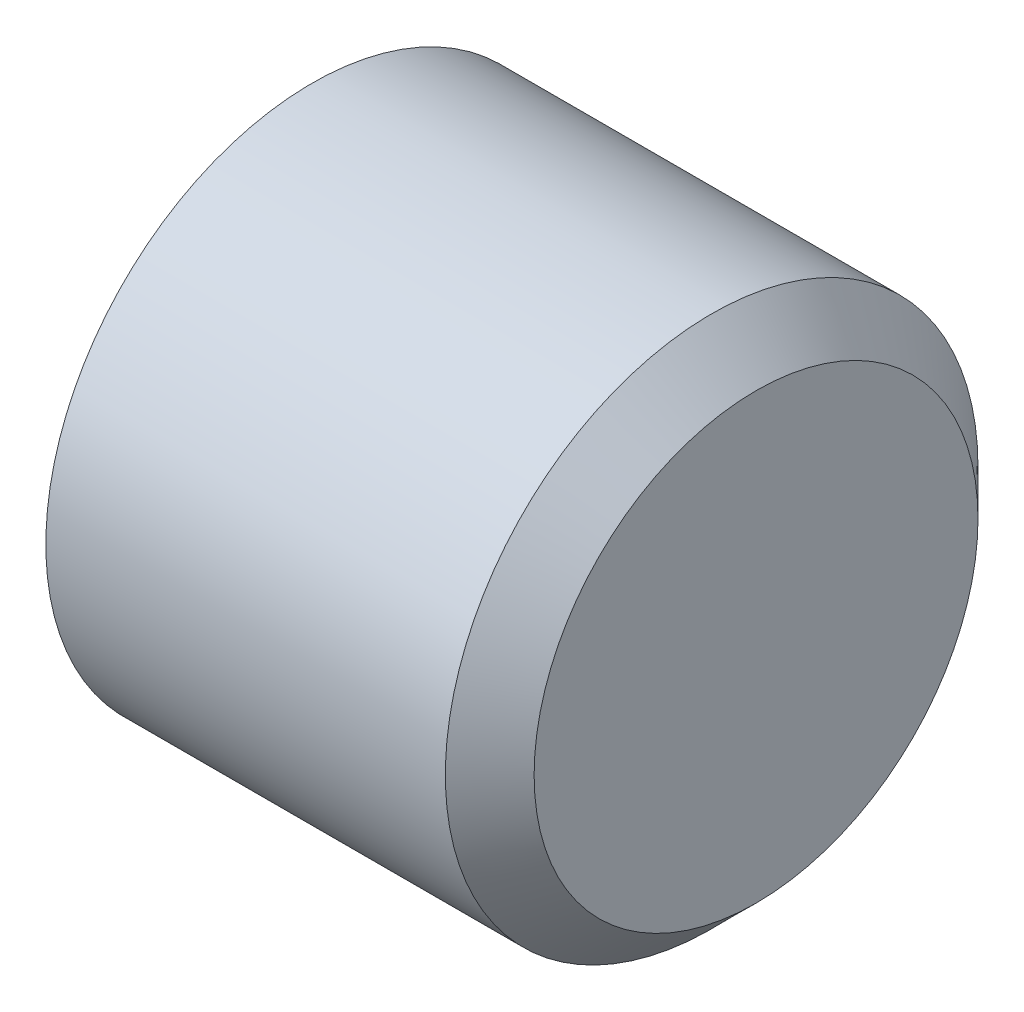
ISO-10303-21;
HEADER;
FILE_DESCRIPTION(('STEP AP214'),'2;1');
FILE_NAME('part.step','',(''),(''),'','','');
FILE_SCHEMA(('AUTOMOTIVE_DESIGN { 1 0 10303 214 1 1 1 1 }'));
ENDSEC;
DATA;
#1=APPLICATION_CONTEXT('core data for automotive mechanical design processes');
#2=APPLICATION_PROTOCOL_DEFINITION('international standard','automotive_design',2000,#1);
#3=PRODUCT_CONTEXT('',#1,'mechanical');
#4=PRODUCT('Part','Part','',(#3));
#5=PRODUCT_RELATED_PRODUCT_CATEGORY('part','',(#4));
#6=PRODUCT_DEFINITION_FORMATION('','',#4);
#7=PRODUCT_DEFINITION_CONTEXT('part definition',#1,'design');
#8=PRODUCT_DEFINITION('design','',#6,#7);
#9=PRODUCT_DEFINITION_SHAPE('','',#8);
#10=(LENGTH_UNIT() NAMED_UNIT(*) SI_UNIT(.MILLI.,.METRE.));
#11=(NAMED_UNIT(*) PLANE_ANGLE_UNIT() SI_UNIT($,.RADIAN.));
#12=(NAMED_UNIT(*) SI_UNIT($,.STERADIAN.) SOLID_ANGLE_UNIT());
#13=UNCERTAINTY_MEASURE_WITH_UNIT(LENGTH_MEASURE(1.E-05),#10,'distance_accuracy_value','');
#14=(GEOMETRIC_REPRESENTATION_CONTEXT(3) GLOBAL_UNCERTAINTY_ASSIGNED_CONTEXT((#13)) GLOBAL_UNIT_ASSIGNED_CONTEXT((#10,
#11,#12)) REPRESENTATION_CONTEXT('',''));
#15=CARTESIAN_POINT('',(0.,0.,0.));
#16=DIRECTION('',(0.,0.,1.));
#17=DIRECTION('',(1.,0.,0.));
#18=AXIS2_PLACEMENT_3D('',#15,#16,#17);
#19=CARTESIAN_POINT('',(5.,0.,0.));
#20=DIRECTION('',(-1.,0.,0.));
#21=DIRECTION('',(0.,0.,1.));
#22=AXIS2_PLACEMENT_3D('',#19,#20,#21);
#23=CYLINDRICAL_SURFACE('',#22,6.);
#24=CARTESIAN_POINT('',(4.,0.,0.));
#25=DIRECTION('',(1.,0.,0.));
#26=DIRECTION('',(0.,0.,-1.));
#27=AXIS2_PLACEMENT_3D('',#24,#25,#26);
#28=CIRCLE('',#27,6.);
#29=CARTESIAN_POINT('',(4.,0.,-6.));
#30=VERTEX_POINT('',#29);
#31=EDGE_CURVE('E11',#30,#30,#28,.F.);
#32=ORIENTED_EDGE('',*,*,#31,.T.);
#33=EDGE_LOOP('',(#32));
#34=FACE_BOUND('',#33,.T.);
#35=CARTESIAN_POINT('',(-5.,0.,0.));
#36=DIRECTION('',(1.,0.,0.));
#37=DIRECTION('',(0.,0.,-1.));
#38=AXIS2_PLACEMENT_3D('',#35,#36,#37);
#39=CIRCLE('',#38,6.);
#40=CARTESIAN_POINT('',(-5.,0.,-6.));
#41=VERTEX_POINT('',#40);
#42=EDGE_CURVE('E69',#41,#41,#39,.T.);
#43=ORIENTED_EDGE('',*,*,#42,.T.);
#44=EDGE_LOOP('',(#43));
#45=FACE_BOUND('',#44,.T.);
#46=ADVANCED_FACE('F46',(#34,#45),#23,.T.);
#47=CARTESIAN_POINT('',(5.,0.,0.));
#48=DIRECTION('',(1.,0.,0.));
#49=DIRECTION('',(0.,0.,-1.));
#50=AXIS2_PLACEMENT_3D('',#47,#48,#49);
#51=PLANE('',#50);
#52=CARTESIAN_POINT('',(5.,0.,0.));
#53=DIRECTION('',(1.,0.,0.));
#54=DIRECTION('',(0.,0.,-1.));
#55=AXIS2_PLACEMENT_3D('',#52,#53,#54);
#56=CIRCLE('',#55,5.00000000000001);
#57=CARTESIAN_POINT('',(5.,0.,-5.00000000000001));
#58=VERTEX_POINT('',#57);
#59=EDGE_CURVE('E55',#58,#58,#56,.T.);
#60=ORIENTED_EDGE('',*,*,#59,.T.);
#61=EDGE_LOOP('',(#60));
#62=FACE_BOUND('',#61,.T.);
#63=ADVANCED_FACE('F84',(#62),#51,.T.);
#64=CARTESIAN_POINT('',(-5.,0.,0.));
#65=DIRECTION('',(1.,0.,0.));
#66=DIRECTION('',(0.,0.,-1.));
#67=AXIS2_PLACEMENT_3D('',#64,#65,#66);
#68=PLANE('',#67);
#69=CARTESIAN_POINT('',(-5.,0.,0.));
#70=DIRECTION('',(-1.,0.,0.));
#71=DIRECTION('',(0.,0.,1.));
#72=AXIS2_PLACEMENT_3D('',#69,#70,#71);
#73=CIRCLE('',#72,2.49999999999999);
#74=CARTESIAN_POINT('',(-5.,0.,2.49999999999999));
#75=VERTEX_POINT('',#74);
#76=EDGE_CURVE('E70',#75,#75,#73,.T.);
#77=ORIENTED_EDGE('',*,*,#76,.F.);
#78=EDGE_LOOP('',(#77));
#79=FACE_BOUND('',#78,.T.);
#80=ORIENTED_EDGE('',*,*,#42,.F.);
#81=EDGE_LOOP('',(#80));
#82=FACE_BOUND('',#81,.T.);
#83=ADVANCED_FACE('F62',(#79,#82),#68,.F.);
#84=CARTESIAN_POINT('',(0.999999999999999,0.,0.));
#85=DIRECTION('',(-1.,0.,0.));
#86=DIRECTION('',(0.,0.,1.));
#87=AXIS2_PLACEMENT_3D('',#84,#85,#86);
#88=CONICAL_SURFACE('',#87,2.5,1.02974425867665);
#89=CARTESIAN_POINT('',(2.5021515475689,0.,0.));
#90=VERTEX_POINT('',#89);
#91=VERTEX_LOOP('',#90);
#92=FACE_BOUND('',#91,.T.);
#93=CARTESIAN_POINT('',(0.999999999999999,0.,0.));
#94=DIRECTION('',(-1.,0.,0.));
#95=DIRECTION('',(0.,0.,1.));
#96=AXIS2_PLACEMENT_3D('',#93,#94,#95);
#97=CIRCLE('',#96,2.5);
#98=CARTESIAN_POINT('',(0.999999999999999,0.,2.5));
#99=VERTEX_POINT('',#98);
#100=EDGE_CURVE('E66',#99,#99,#97,.T.);
#101=ORIENTED_EDGE('',*,*,#100,.T.);
#102=EDGE_LOOP('',(#101));
#103=FACE_BOUND('',#102,.T.);
#104=ADVANCED_FACE('F58',(#92,#103),#88,.F.);
#105=CARTESIAN_POINT('',(-5.,0.,0.));
#106=DIRECTION('',(-1.,0.,0.));
#107=DIRECTION('',(0.,0.,1.));
#108=AXIS2_PLACEMENT_3D('',#105,#106,#107);
#109=CYLINDRICAL_SURFACE('',#108,2.49999999999999);
#110=ORIENTED_EDGE('',*,*,#100,.F.);
#111=EDGE_LOOP('',(#110));
#112=FACE_BOUND('',#111,.T.);
#113=ORIENTED_EDGE('',*,*,#76,.T.);
#114=EDGE_LOOP('',(#113));
#115=FACE_BOUND('',#114,.T.);
#116=ADVANCED_FACE('F61',(#112,#115),#109,.F.);
#117=CARTESIAN_POINT('',(5.,0.,0.));
#118=DIRECTION('',(-1.,0.,0.));
#119=DIRECTION('',(0.,0.,1.));
#120=AXIS2_PLACEMENT_3D('',#117,#118,#119);
#121=CONICAL_SURFACE('',#120,5.00000000000001,0.785398163397447);
#122=ORIENTED_EDGE('',*,*,#31,.F.);
#123=EDGE_LOOP('',(#122));
#124=FACE_BOUND('',#123,.T.);
#125=ORIENTED_EDGE('',*,*,#59,.F.);
#126=EDGE_LOOP('',(#125));
#127=FACE_BOUND('',#126,.T.);
#128=ADVANCED_FACE('F49',(#124,#127),#121,.T.);
#129=CLOSED_SHELL('',(#46,#63,#83,#104,#116,#128));
#130=MANIFOLD_SOLID_BREP('B2',#129);
#131=ADVANCED_BREP_SHAPE_REPRESENTATION('',(#18,#130),#14);
#132=SHAPE_DEFINITION_REPRESENTATION(#9,#131);
ENDSEC;
END-ISO-10303-21;
